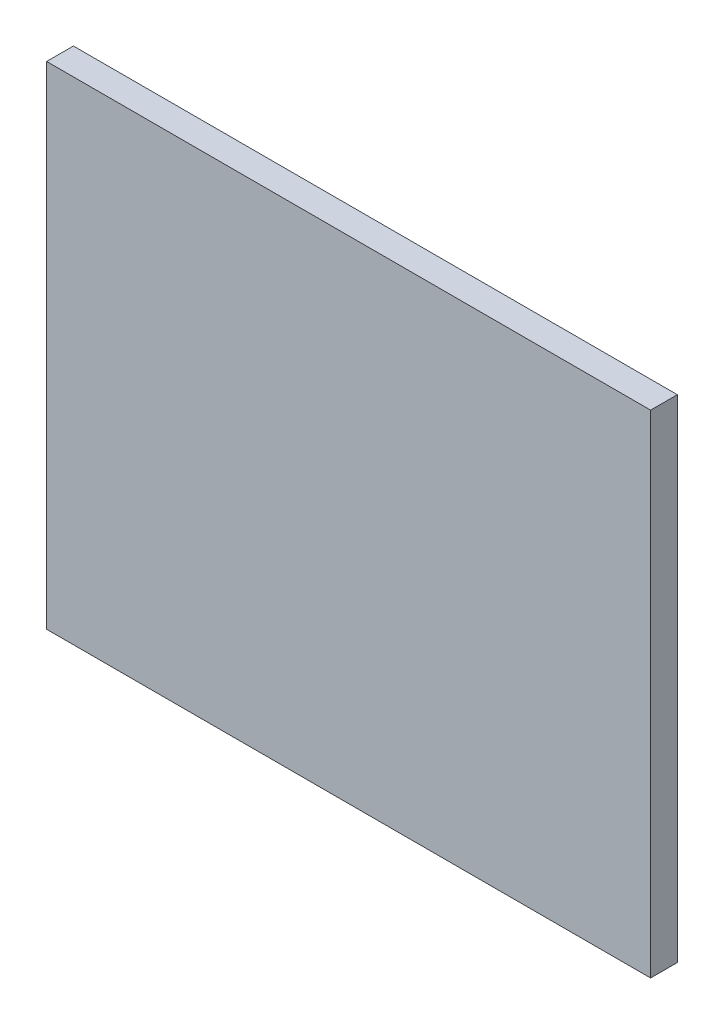
ISO-10303-21;
HEADER;
FILE_DESCRIPTION(('STEP AP214'),'2;1');
FILE_NAME('part.step','',(''),(''),'','','');
FILE_SCHEMA(('AUTOMOTIVE_DESIGN { 1 0 10303 214 1 1 1 1 }'));
ENDSEC;
DATA;
#1=APPLICATION_CONTEXT('core data for automotive mechanical design processes');
#2=APPLICATION_PROTOCOL_DEFINITION('international standard','automotive_design',2000,#1);
#3=PRODUCT_CONTEXT('',#1,'mechanical');
#4=PRODUCT('Part','Part','',(#3));
#5=PRODUCT_RELATED_PRODUCT_CATEGORY('part','',(#4));
#6=PRODUCT_DEFINITION_FORMATION('','',#4);
#7=PRODUCT_DEFINITION_CONTEXT('part definition',#1,'design');
#8=PRODUCT_DEFINITION('design','',#6,#7);
#9=PRODUCT_DEFINITION_SHAPE('','',#8);
#10=(LENGTH_UNIT() NAMED_UNIT(*) SI_UNIT(.MILLI.,.METRE.));
#11=(NAMED_UNIT(*) PLANE_ANGLE_UNIT() SI_UNIT($,.RADIAN.));
#12=(NAMED_UNIT(*) SI_UNIT($,.STERADIAN.) SOLID_ANGLE_UNIT());
#13=UNCERTAINTY_MEASURE_WITH_UNIT(LENGTH_MEASURE(1.E-05),#10,'distance_accuracy_value','');
#14=(GEOMETRIC_REPRESENTATION_CONTEXT(3) GLOBAL_UNCERTAINTY_ASSIGNED_CONTEXT((#13)) GLOBAL_UNIT_ASSIGNED_CONTEXT((#10,
#11,#12)) REPRESENTATION_CONTEXT('',''));
#15=CARTESIAN_POINT('',(0.,0.,0.));
#16=DIRECTION('',(0.,0.,1.));
#17=DIRECTION('',(1.,0.,0.));
#18=AXIS2_PLACEMENT_3D('',#15,#16,#17);
#19=CARTESIAN_POINT('',(105.,-85.5,9.3));
#20=DIRECTION('',(-1.,0.,0.));
#21=DIRECTION('',(0.,0.,1.));
#22=AXIS2_PLACEMENT_3D('',#19,#20,#21);
#23=PLANE('',#22);
#24=DIRECTION('',(0.,1.,0.));
#25=VECTOR('',#24,1.);
#26=CARTESIAN_POINT('',(105.,-85.5,0.));
#27=LINE('',#26,#25);
#28=CARTESIAN_POINT('',(105.,-85.5,0.));
#29=VERTEX_POINT('',#28);
#30=CARTESIAN_POINT('',(105.,85.5,0.));
#31=VERTEX_POINT('',#30);
#32=EDGE_CURVE('E97',#29,#31,#27,.T.);
#33=ORIENTED_EDGE('',*,*,#32,.T.);
#34=DIRECTION('',(0.,0.,-1.));
#35=VECTOR('',#34,1.);
#36=CARTESIAN_POINT('',(105.,85.5,9.3));
#37=LINE('',#36,#35);
#38=CARTESIAN_POINT('',(105.,85.5,9.3));
#39=VERTEX_POINT('',#38);
#40=EDGE_CURVE('E11',#39,#31,#37,.T.);
#41=ORIENTED_EDGE('',*,*,#40,.F.);
#42=DIRECTION('',(0.,1.,0.));
#43=VECTOR('',#42,1.);
#44=CARTESIAN_POINT('',(105.,-85.5,9.3));
#45=LINE('',#44,#43);
#46=CARTESIAN_POINT('',(105.,-85.5,9.3));
#47=VERTEX_POINT('',#46);
#48=EDGE_CURVE('E85',#47,#39,#45,.T.);
#49=ORIENTED_EDGE('',*,*,#48,.F.);
#50=DIRECTION('',(0.,0.,-1.));
#51=VECTOR('',#50,1.);
#52=CARTESIAN_POINT('',(105.,-85.5,9.3));
#53=LINE('',#52,#51);
#54=EDGE_CURVE('E93',#47,#29,#53,.T.);
#55=ORIENTED_EDGE('',*,*,#54,.T.);
#56=EDGE_LOOP('',(#33,#41,#49,#55));
#57=FACE_BOUND('',#56,.T.);
#58=ADVANCED_FACE('F34',(#57),#23,.F.);
#59=CARTESIAN_POINT('',(-105.,85.5,9.3));
#60=DIRECTION('',(0.,-1.,0.));
#61=DIRECTION('',(0.,0.,-1.));
#62=AXIS2_PLACEMENT_3D('',#59,#60,#61);
#63=PLANE('',#62);
#64=DIRECTION('',(-1.,0.,0.));
#65=VECTOR('',#64,1.);
#66=CARTESIAN_POINT('',(-105.,85.5,0.));
#67=LINE('',#66,#65);
#68=CARTESIAN_POINT('',(-105.,85.5,0.));
#69=VERTEX_POINT('',#68);
#70=EDGE_CURVE('E89',#31,#69,#67,.T.);
#71=ORIENTED_EDGE('',*,*,#70,.T.);
#72=DIRECTION('',(0.,0.,-1.));
#73=VECTOR('',#72,1.);
#74=CARTESIAN_POINT('',(-105.,85.5,9.3));
#75=LINE('',#74,#73);
#76=CARTESIAN_POINT('',(-105.,85.5,9.3));
#77=VERTEX_POINT('',#76);
#78=EDGE_CURVE('E42',#77,#69,#75,.T.);
#79=ORIENTED_EDGE('',*,*,#78,.F.);
#80=DIRECTION('',(-1.,0.,0.));
#81=VECTOR('',#80,1.);
#82=CARTESIAN_POINT('',(-105.,85.5,9.3));
#83=LINE('',#82,#81);
#84=EDGE_CURVE('E80',#39,#77,#83,.T.);
#85=ORIENTED_EDGE('',*,*,#84,.F.);
#86=ORIENTED_EDGE('',*,*,#40,.T.);
#87=EDGE_LOOP('',(#71,#79,#85,#86));
#88=FACE_BOUND('',#87,.T.);
#89=ADVANCED_FACE('F88',(#88),#63,.F.);
#90=CARTESIAN_POINT('',(-105.,-85.5,9.3));
#91=DIRECTION('',(1.,0.,0.));
#92=DIRECTION('',(0.,0.,-1.));
#93=AXIS2_PLACEMENT_3D('',#90,#91,#92);
#94=PLANE('',#93);
#95=DIRECTION('',(0.,-1.,0.));
#96=VECTOR('',#95,1.);
#97=CARTESIAN_POINT('',(-105.,-85.5,0.));
#98=LINE('',#97,#96);
#99=CARTESIAN_POINT('',(-105.,-85.5,0.));
#100=VERTEX_POINT('',#99);
#101=EDGE_CURVE('E67',#69,#100,#98,.T.);
#102=ORIENTED_EDGE('',*,*,#101,.T.);
#103=DIRECTION('',(0.,0.,-1.));
#104=VECTOR('',#103,1.);
#105=CARTESIAN_POINT('',(-105.,-85.5,9.3));
#106=LINE('',#105,#104);
#107=CARTESIAN_POINT('',(-105.,-85.5,9.3));
#108=VERTEX_POINT('',#107);
#109=EDGE_CURVE('E90',#108,#100,#106,.T.);
#110=ORIENTED_EDGE('',*,*,#109,.F.);
#111=DIRECTION('',(0.,-1.,0.));
#112=VECTOR('',#111,1.);
#113=CARTESIAN_POINT('',(-105.,-85.5,9.3));
#114=LINE('',#113,#112);
#115=EDGE_CURVE('E83',#77,#108,#114,.T.);
#116=ORIENTED_EDGE('',*,*,#115,.F.);
#117=ORIENTED_EDGE('',*,*,#78,.T.);
#118=EDGE_LOOP('',(#102,#110,#116,#117));
#119=FACE_BOUND('',#118,.T.);
#120=ADVANCED_FACE('F91',(#119),#94,.F.);
#121=CARTESIAN_POINT('',(-105.,-85.5,9.3));
#122=DIRECTION('',(0.,1.,0.));
#123=DIRECTION('',(0.,0.,1.));
#124=AXIS2_PLACEMENT_3D('',#121,#122,#123);
#125=PLANE('',#124);
#126=DIRECTION('',(1.,0.,0.));
#127=VECTOR('',#126,1.);
#128=CARTESIAN_POINT('',(-105.,-85.5,0.));
#129=LINE('',#128,#127);
#130=EDGE_CURVE('E73',#100,#29,#129,.T.);
#131=ORIENTED_EDGE('',*,*,#130,.T.);
#132=ORIENTED_EDGE('',*,*,#54,.F.);
#133=DIRECTION('',(1.,0.,0.));
#134=VECTOR('',#133,1.);
#135=CARTESIAN_POINT('',(-105.,-85.5,9.3));
#136=LINE('',#135,#134);
#137=EDGE_CURVE('E50',#108,#47,#136,.T.);
#138=ORIENTED_EDGE('',*,*,#137,.F.);
#139=ORIENTED_EDGE('',*,*,#109,.T.);
#140=EDGE_LOOP('',(#131,#132,#138,#139));
#141=FACE_BOUND('',#140,.T.);
#142=ADVANCED_FACE('F104',(#141),#125,.F.);
#143=CARTESIAN_POINT('',(0.,0.,9.3));
#144=DIRECTION('',(0.,0.,-1.));
#145=DIRECTION('',(-1.,0.,0.));
#146=AXIS2_PLACEMENT_3D('',#143,#144,#145);
#147=PLANE('',#146);
#148=ORIENTED_EDGE('',*,*,#48,.T.);
#149=ORIENTED_EDGE('',*,*,#84,.T.);
#150=ORIENTED_EDGE('',*,*,#115,.T.);
#151=ORIENTED_EDGE('',*,*,#137,.T.);
#152=EDGE_LOOP('',(#148,#149,#150,#151));
#153=FACE_BOUND('',#152,.T.);
#154=ADVANCED_FACE('F81',(#153),#147,.F.);
#155=CARTESIAN_POINT('',(0.,0.,0.));
#156=DIRECTION('',(0.,0.,-1.));
#157=DIRECTION('',(-1.,0.,0.));
#158=AXIS2_PLACEMENT_3D('',#155,#156,#157);
#159=PLANE('',#158);
#160=ORIENTED_EDGE('',*,*,#32,.F.);
#161=ORIENTED_EDGE('',*,*,#130,.F.);
#162=ORIENTED_EDGE('',*,*,#101,.F.);
#163=ORIENTED_EDGE('',*,*,#70,.F.);
#164=EDGE_LOOP('',(#160,#161,#162,#163));
#165=FACE_BOUND('',#164,.T.);
#166=ADVANCED_FACE('F107',(#165),#159,.T.);
#167=CLOSED_SHELL('',(#58,#89,#120,#142,#154,#166));
#168=MANIFOLD_SOLID_BREP('B2',#167);
#169=ADVANCED_BREP_SHAPE_REPRESENTATION('',(#18,#168),#14);
#170=SHAPE_DEFINITION_REPRESENTATION(#9,#169);
ENDSEC;
END-ISO-10303-21;
